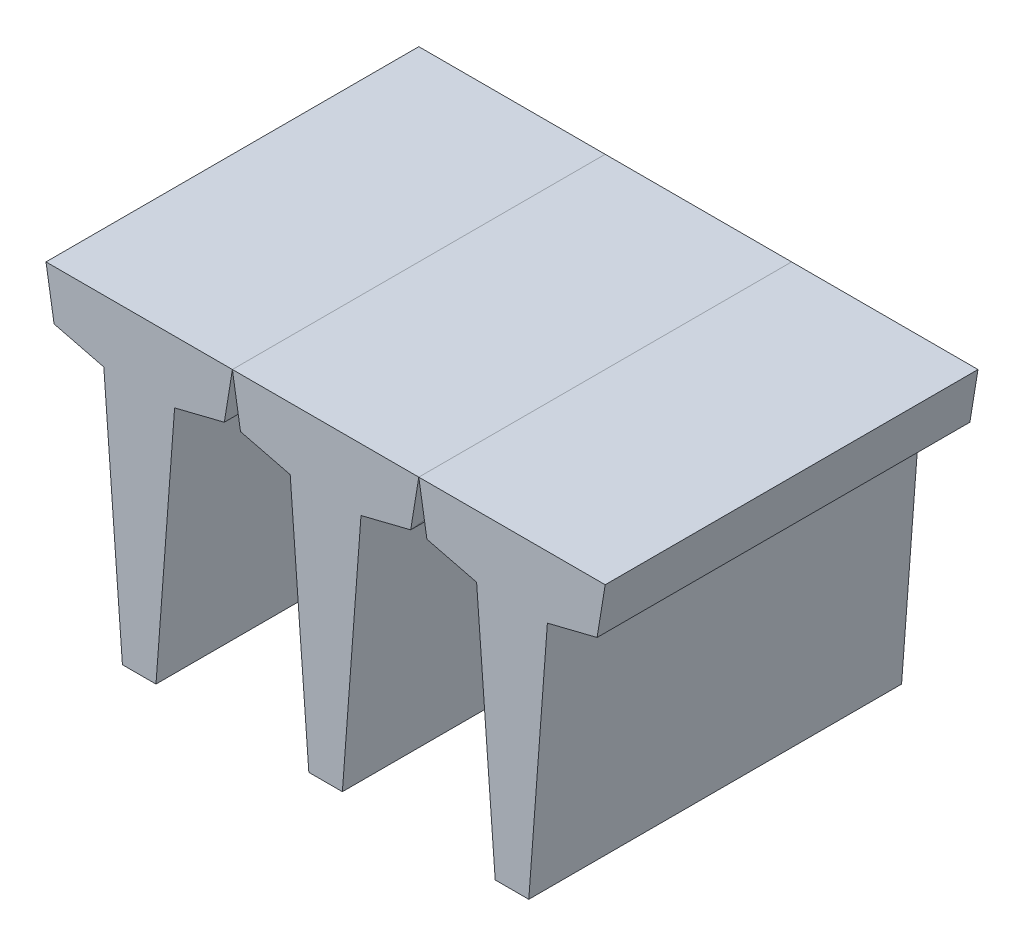
ISO-10303-21;
HEADER;
FILE_DESCRIPTION(('STEP AP214'),'2;1');
FILE_NAME('part.step','',(''),(''),'','','');
FILE_SCHEMA(('AUTOMOTIVE_DESIGN { 1 0 10303 214 1 1 1 1 }'));
ENDSEC;
DATA;
#1=APPLICATION_CONTEXT('core data for automotive mechanical design processes');
#2=APPLICATION_PROTOCOL_DEFINITION('international standard','automotive_design',2000,#1);
#3=PRODUCT_CONTEXT('',#1,'mechanical');
#4=PRODUCT('Part','Part','',(#3));
#5=PRODUCT_RELATED_PRODUCT_CATEGORY('part','',(#4));
#6=PRODUCT_DEFINITION_FORMATION('','',#4);
#7=PRODUCT_DEFINITION_CONTEXT('part definition',#1,'design');
#8=PRODUCT_DEFINITION('design','',#6,#7);
#9=PRODUCT_DEFINITION_SHAPE('','',#8);
#10=(LENGTH_UNIT() NAMED_UNIT(*) SI_UNIT(.MILLI.,.METRE.));
#11=(NAMED_UNIT(*) PLANE_ANGLE_UNIT() SI_UNIT($,.RADIAN.));
#12=(NAMED_UNIT(*) SI_UNIT($,.STERADIAN.) SOLID_ANGLE_UNIT());
#13=UNCERTAINTY_MEASURE_WITH_UNIT(LENGTH_MEASURE(1.E-05),#10,'distance_accuracy_value','');
#14=(GEOMETRIC_REPRESENTATION_CONTEXT(3) GLOBAL_UNCERTAINTY_ASSIGNED_CONTEXT((#13)) GLOBAL_UNIT_ASSIGNED_CONTEXT((#10,
#11,#12)) REPRESENTATION_CONTEXT('',''));
#15=CARTESIAN_POINT('',(0.,0.,0.));
#16=DIRECTION('',(0.,0.,1.));
#17=DIRECTION('',(1.,0.,0.));
#18=AXIS2_PLACEMENT_3D('',#15,#16,#17);
#19=CARTESIAN_POINT('',(-271.946864525165,-20.3667142399668,3000.));
#20=DIRECTION('',(-0.997207317311785,-0.0746831058528849,0.));
#21=DIRECTION('',(0.0746831058528849,-0.997207317311785,0.));
#22=AXIS2_PLACEMENT_3D('',#19,#20,#21);
#23=PLANE('',#22);
#24=DIRECTION('',(-0.0746831058528849,0.997207317311785,0.));
#25=VECTOR('',#24,1.);
#26=CARTESIAN_POINT('',(-271.946864525165,-20.3667142399668,0.));
#27=LINE('',#26,#25);
#28=CARTESIAN_POINT('',(-135.02426812289,-1848.6277845099,0.));
#29=VERTEX_POINT('',#28);
#30=CARTESIAN_POINT('',(-284.808780443179,151.372215490104,0.));
#31=VERTEX_POINT('',#30);
#32=EDGE_CURVE('E153',#29,#31,#27,.T.);
#33=ORIENTED_EDGE('',*,*,#32,.F.);
#34=DIRECTION('',(0.,0.,-1.));
#35=VECTOR('',#34,1.);
#36=CARTESIAN_POINT('',(-135.02426812289,-1848.6277845099,3000.));
#37=LINE('',#36,#35);
#38=CARTESIAN_POINT('',(-135.02426812289,-1848.6277845099,3000.));
#39=VERTEX_POINT('',#38);
#40=EDGE_CURVE('E12',#39,#29,#37,.T.);
#41=ORIENTED_EDGE('',*,*,#40,.F.);
#42=DIRECTION('',(-0.0746831058528849,0.997207317311785,0.));
#43=VECTOR('',#42,1.);
#44=CARTESIAN_POINT('',(-271.946864525165,-20.3667142399668,3000.));
#45=LINE('',#44,#43);
#46=CARTESIAN_POINT('',(-284.808780443179,151.372215490104,3000.));
#47=VERTEX_POINT('',#46);
#48=EDGE_CURVE('E177',#39,#47,#45,.T.);
#49=ORIENTED_EDGE('',*,*,#48,.T.);
#50=DIRECTION('',(0.,0.,-1.));
#51=VECTOR('',#50,1.);
#52=CARTESIAN_POINT('',(-284.808780443179,151.372215490104,3000.));
#53=LINE('',#52,#51);
#54=EDGE_CURVE('E71',#47,#31,#53,.T.);
#55=ORIENTED_EDGE('',*,*,#54,.T.);
#56=EDGE_LOOP('',(#33,#41,#49,#55));
#57=FACE_BOUND('',#56,.T.);
#58=ADVANCED_FACE('F54',(#57),#23,.T.);
#59=CARTESIAN_POINT('',(0.,-1848.6277845099,3000.));
#60=DIRECTION('',(0.,1.,0.));
#61=DIRECTION('',(0.,0.,1.));
#62=AXIS2_PLACEMENT_3D('',#59,#60,#61);
#63=PLANE('',#62);
#64=DIRECTION('',(1.,0.,0.));
#65=VECTOR('',#64,1.);
#66=CARTESIAN_POINT('',(0.,-1848.6277845099,0.));
#67=LINE('',#66,#65);
#68=CARTESIAN_POINT('',(135.02426812289,-1848.6277845099,0.));
#69=VERTEX_POINT('',#68);
#70=EDGE_CURVE('E156',#29,#69,#67,.T.);
#71=ORIENTED_EDGE('',*,*,#70,.T.);
#72=DIRECTION('',(0.,0.,-1.));
#73=VECTOR('',#72,1.);
#74=CARTESIAN_POINT('',(135.02426812289,-1848.6277845099,3000.));
#75=LINE('',#74,#73);
#76=CARTESIAN_POINT('',(135.02426812289,-1848.6277845099,3000.));
#77=VERTEX_POINT('',#76);
#78=EDGE_CURVE('E63',#77,#69,#75,.T.);
#79=ORIENTED_EDGE('',*,*,#78,.F.);
#80=DIRECTION('',(1.,0.,0.));
#81=VECTOR('',#80,1.);
#82=CARTESIAN_POINT('',(0.,-1848.6277845099,3000.));
#83=LINE('',#82,#81);
#84=EDGE_CURVE('E219',#39,#77,#83,.T.);
#85=ORIENTED_EDGE('',*,*,#84,.F.);
#86=ORIENTED_EDGE('',*,*,#40,.T.);
#87=EDGE_LOOP('',(#71,#79,#85,#86));
#88=FACE_BOUND('',#87,.T.);
#89=ADVANCED_FACE('F234',(#88),#63,.F.);
#90=CARTESIAN_POINT('',(271.946864525166,-20.3667142399668,3000.));
#91=DIRECTION('',(-0.997207317311785,0.0746831058528846,0.));
#92=DIRECTION('',(-0.0746831058528846,-0.997207317311785,0.));
#93=AXIS2_PLACEMENT_3D('',#90,#91,#92);
#94=PLANE('',#93);
#95=DIRECTION('',(0.0746831058528846,0.997207317311785,0.));
#96=VECTOR('',#95,1.);
#97=CARTESIAN_POINT('',(271.946864525166,-20.3667142399668,0.));
#98=LINE('',#97,#96);
#99=CARTESIAN_POINT('',(284.808780443179,151.372215490104,0.));
#100=VERTEX_POINT('',#99);
#101=EDGE_CURVE('E159',#69,#100,#98,.T.);
#102=ORIENTED_EDGE('',*,*,#101,.T.);
#103=DIRECTION('',(0.,0.,-1.));
#104=VECTOR('',#103,1.);
#105=CARTESIAN_POINT('',(284.808780443179,151.372215490104,3000.));
#106=LINE('',#105,#104);
#107=CARTESIAN_POINT('',(284.808780443179,151.372215490104,3000.));
#108=VERTEX_POINT('',#107);
#109=EDGE_CURVE('E188',#108,#100,#106,.T.);
#110=ORIENTED_EDGE('',*,*,#109,.F.);
#111=DIRECTION('',(0.0746831058528846,0.997207317311785,0.));
#112=VECTOR('',#111,1.);
#113=CARTESIAN_POINT('',(271.946864525166,-20.3667142399668,3000.));
#114=LINE('',#113,#112);
#115=EDGE_CURVE('E199',#77,#108,#114,.T.);
#116=ORIENTED_EDGE('',*,*,#115,.F.);
#117=ORIENTED_EDGE('',*,*,#78,.T.);
#118=EDGE_LOOP('',(#102,#110,#116,#117));
#119=FACE_BOUND('',#118,.T.);
#120=ADVANCED_FACE('F197',(#119),#94,.F.);
#121=CARTESIAN_POINT('',(-18.8635342068963,75.454136827585,3000.));
#122=DIRECTION('',(-0.242535625036333,0.970142500145332,0.));
#123=DIRECTION('',(-0.970142500145332,-0.242535625036333,0.));
#124=AXIS2_PLACEMENT_3D('',#121,#122,#123);
#125=PLANE('',#124);
#126=DIRECTION('',(0.970142500145332,0.242535625036333,0.));
#127=VECTOR('',#126,1.);
#128=CARTESIAN_POINT('',(-18.8635342068963,75.454136827585,0.));
#129=LINE('',#128,#127);
#130=CARTESIAN_POINT('',(684.808780443179,251.372215490104,0.));
#131=VERTEX_POINT('',#130);
#132=EDGE_CURVE('E162',#100,#131,#129,.T.);
#133=ORIENTED_EDGE('',*,*,#132,.T.);
#134=DIRECTION('',(0.,0.,-1.));
#135=VECTOR('',#134,1.);
#136=CARTESIAN_POINT('',(684.808780443179,251.372215490104,3000.));
#137=LINE('',#136,#135);
#138=CARTESIAN_POINT('',(684.808780443179,251.372215490104,3000.));
#139=VERTEX_POINT('',#138);
#140=EDGE_CURVE('E184',#139,#131,#137,.T.);
#141=ORIENTED_EDGE('',*,*,#140,.F.);
#142=DIRECTION('',(0.970142500145332,0.242535625036333,0.));
#143=VECTOR('',#142,1.);
#144=CARTESIAN_POINT('',(-18.8635342068963,75.454136827585,3000.));
#145=LINE('',#144,#143);
#146=EDGE_CURVE('E213',#108,#139,#145,.T.);
#147=ORIENTED_EDGE('',*,*,#146,.F.);
#148=ORIENTED_EDGE('',*,*,#109,.T.);
#149=EDGE_LOOP('',(#133,#141,#147,#148));
#150=FACE_BOUND('',#149,.T.);
#151=ADVANCED_FACE('F208',(#150),#125,.F.);
#152=CARTESIAN_POINT('',(627.181529019599,-102.216821900748,3000.));
#153=DIRECTION('',(-0.986977928746855,0.160855737126682,0.));
#154=DIRECTION('',(-0.160855737126682,-0.986977928746855,0.));
#155=AXIS2_PLACEMENT_3D('',#152,#153,#154);
#156=PLANE('',#155);
#157=DIRECTION('',(0.160855737126682,0.986977928746855,0.));
#158=VECTOR('',#157,1.);
#159=CARTESIAN_POINT('',(627.181529019599,-102.216821900748,0.));
#160=LINE('',#159,#158);
#161=CARTESIAN_POINT('',(750.,651.372215490104,0.));
#162=VERTEX_POINT('',#161);
#163=EDGE_CURVE('E165',#131,#162,#160,.T.);
#164=ORIENTED_EDGE('',*,*,#163,.T.);
#165=DIRECTION('',(0.,0.,-1.));
#166=VECTOR('',#165,1.);
#167=CARTESIAN_POINT('',(750.,651.372215490104,3000.));
#168=LINE('',#167,#166);
#169=CARTESIAN_POINT('',(750.,651.372215490104,3000.));
#170=VERTEX_POINT('',#169);
#171=EDGE_CURVE('E143',#170,#162,#168,.T.);
#172=ORIENTED_EDGE('',*,*,#171,.F.);
#173=DIRECTION('',(0.160855737126682,0.986977928746855,0.));
#174=VECTOR('',#173,1.);
#175=CARTESIAN_POINT('',(627.181529019599,-102.216821900748,3000.));
#176=LINE('',#175,#174);
#177=EDGE_CURVE('E129',#139,#170,#176,.T.);
#178=ORIENTED_EDGE('',*,*,#177,.F.);
#179=ORIENTED_EDGE('',*,*,#140,.T.);
#180=EDGE_LOOP('',(#164,#172,#178,#179));
#181=FACE_BOUND('',#180,.T.);
#182=ADVANCED_FACE('F211',(#181),#156,.F.);
#183=CARTESIAN_POINT('',(0.,651.372215490104,3000.));
#184=DIRECTION('',(0.,-1.,0.));
#185=DIRECTION('',(0.,0.,-1.));
#186=AXIS2_PLACEMENT_3D('',#183,#184,#185);
#187=PLANE('',#186);
#188=DIRECTION('',(-1.,0.,0.));
#189=VECTOR('',#188,1.);
#190=CARTESIAN_POINT('',(0.,651.372215490104,0.));
#191=LINE('',#190,#189);
#192=CARTESIAN_POINT('',(-750.,651.372215490104,0.));
#193=VERTEX_POINT('',#192);
#194=EDGE_CURVE('E139',#162,#193,#191,.T.);
#195=ORIENTED_EDGE('',*,*,#194,.T.);
#196=DIRECTION('',(0.,0.,-1.));
#197=VECTOR('',#196,1.);
#198=CARTESIAN_POINT('',(-750.,651.372215490104,3000.));
#199=LINE('',#198,#197);
#200=CARTESIAN_POINT('',(-750.,651.372215490104,3000.));
#201=VERTEX_POINT('',#200);
#202=EDGE_CURVE('E136',#201,#193,#199,.T.);
#203=ORIENTED_EDGE('',*,*,#202,.F.);
#204=DIRECTION('',(-1.,0.,0.));
#205=VECTOR('',#204,1.);
#206=CARTESIAN_POINT('',(0.,651.372215490104,3000.));
#207=LINE('',#206,#205);
#208=EDGE_CURVE('E121',#170,#201,#207,.T.);
#209=ORIENTED_EDGE('',*,*,#208,.F.);
#210=ORIENTED_EDGE('',*,*,#171,.T.);
#211=EDGE_LOOP('',(#195,#203,#209,#210));
#212=FACE_BOUND('',#211,.T.);
#213=ADVANCED_FACE('F137',(#212),#187,.F.);
#214=CARTESIAN_POINT('',(-627.181529019599,-102.216821900748,3000.));
#215=DIRECTION('',(-0.986977928746855,-0.160855737126681,0.));
#216=DIRECTION('',(0.160855737126681,-0.986977928746855,0.));
#217=AXIS2_PLACEMENT_3D('',#214,#215,#216);
#218=PLANE('',#217);
#219=DIRECTION('',(-0.160855737126682,0.986977928746855,0.));
#220=VECTOR('',#219,1.);
#221=CARTESIAN_POINT('',(-627.181529019599,-102.216821900748,0.));
#222=LINE('',#221,#220);
#223=CARTESIAN_POINT('',(-684.808780443179,251.372215490104,0.));
#224=VERTEX_POINT('',#223);
#225=EDGE_CURVE('E170',#224,#193,#222,.T.);
#226=ORIENTED_EDGE('',*,*,#225,.F.);
#227=DIRECTION('',(0.,0.,-1.));
#228=VECTOR('',#227,1.);
#229=CARTESIAN_POINT('',(-684.808780443179,251.372215490104,3000.));
#230=LINE('',#229,#228);
#231=CARTESIAN_POINT('',(-684.808780443179,251.372215490104,3000.));
#232=VERTEX_POINT('',#231);
#233=EDGE_CURVE('E96',#232,#224,#230,.T.);
#234=ORIENTED_EDGE('',*,*,#233,.F.);
#235=DIRECTION('',(-0.160855737126682,0.986977928746855,0.));
#236=VECTOR('',#235,1.);
#237=CARTESIAN_POINT('',(-627.181529019599,-102.216821900748,3000.));
#238=LINE('',#237,#236);
#239=EDGE_CURVE('E127',#232,#201,#238,.T.);
#240=ORIENTED_EDGE('',*,*,#239,.T.);
#241=ORIENTED_EDGE('',*,*,#202,.T.);
#242=EDGE_LOOP('',(#226,#234,#240,#241));
#243=FACE_BOUND('',#242,.T.);
#244=ADVANCED_FACE('F145',(#243),#218,.T.);
#245=CARTESIAN_POINT('',(18.8635342068963,75.4541368275851,3000.));
#246=DIRECTION('',(-0.242535625036333,-0.970142500145332,0.));
#247=DIRECTION('',(0.970142500145332,-0.242535625036333,0.));
#248=AXIS2_PLACEMENT_3D('',#245,#246,#247);
#249=PLANE('',#248);
#250=DIRECTION('',(-0.970142500145332,0.242535625036333,0.));
#251=VECTOR('',#250,1.);
#252=CARTESIAN_POINT('',(18.8635342068963,75.4541368275851,0.));
#253=LINE('',#252,#251);
#254=EDGE_CURVE('E173',#31,#224,#253,.T.);
#255=ORIENTED_EDGE('',*,*,#254,.F.);
#256=ORIENTED_EDGE('',*,*,#54,.F.);
#257=DIRECTION('',(-0.970142500145332,0.242535625036333,0.));
#258=VECTOR('',#257,1.);
#259=CARTESIAN_POINT('',(18.8635342068963,75.4541368275851,3000.));
#260=LINE('',#259,#258);
#261=EDGE_CURVE('E147',#47,#232,#260,.T.);
#262=ORIENTED_EDGE('',*,*,#261,.T.);
#263=ORIENTED_EDGE('',*,*,#233,.T.);
#264=EDGE_LOOP('',(#255,#256,#262,#263));
#265=FACE_BOUND('',#264,.T.);
#266=ADVANCED_FACE('F223',(#265),#249,.T.);
#267=CARTESIAN_POINT('',(0.,0.,3000.));
#268=DIRECTION('',(0.,0.,1.));
#269=DIRECTION('',(1.,0.,0.));
#270=AXIS2_PLACEMENT_3D('',#267,#268,#269);
#271=PLANE('',#270);
#272=ORIENTED_EDGE('',*,*,#48,.F.);
#273=ORIENTED_EDGE('',*,*,#84,.T.);
#274=ORIENTED_EDGE('',*,*,#115,.T.);
#275=ORIENTED_EDGE('',*,*,#146,.T.);
#276=ORIENTED_EDGE('',*,*,#177,.T.);
#277=ORIENTED_EDGE('',*,*,#208,.T.);
#278=ORIENTED_EDGE('',*,*,#239,.F.);
#279=ORIENTED_EDGE('',*,*,#261,.F.);
#280=EDGE_LOOP('',(#272,#273,#274,#275,#276,#277,#278,#279));
#281=FACE_BOUND('',#280,.T.);
#282=ADVANCED_FACE('F124',(#281),#271,.T.);
#283=CARTESIAN_POINT('',(0.,0.,0.));
#284=DIRECTION('',(0.,0.,1.));
#285=DIRECTION('',(1.,0.,0.));
#286=AXIS2_PLACEMENT_3D('',#283,#284,#285);
#287=PLANE('',#286);
#288=ORIENTED_EDGE('',*,*,#32,.T.);
#289=ORIENTED_EDGE('',*,*,#254,.T.);
#290=ORIENTED_EDGE('',*,*,#225,.T.);
#291=ORIENTED_EDGE('',*,*,#194,.F.);
#292=ORIENTED_EDGE('',*,*,#163,.F.);
#293=ORIENTED_EDGE('',*,*,#132,.F.);
#294=ORIENTED_EDGE('',*,*,#101,.F.);
#295=ORIENTED_EDGE('',*,*,#70,.F.);
#296=EDGE_LOOP('',(#288,#289,#290,#291,#292,#293,#294,#295));
#297=FACE_BOUND('',#296,.T.);
#298=ADVANCED_FACE('F204',(#297),#287,.F.);
#299=CLOSED_SHELL('',(#58,#89,#120,#151,#182,#213,#244,#266,#282,#298));
#300=MANIFOLD_SOLID_BREP('B2',#299);
#301=CARTESIAN_POINT('',(-1771.94686452517,-20.3667142399668,3000.));
#302=DIRECTION('',(-0.997207317311785,-0.0746831058528849,0.));
#303=DIRECTION('',(0.0746831058528849,-0.997207317311785,0.));
#304=AXIS2_PLACEMENT_3D('',#301,#302,#303);
#305=PLANE('',#304);
#306=DIRECTION('',(-0.0746831058528849,0.997207317311785,0.));
#307=VECTOR('',#306,1.);
#308=CARTESIAN_POINT('',(-1771.94686452517,-20.3667142399668,0.));
#309=LINE('',#308,#307);
#310=CARTESIAN_POINT('',(-1635.02426812289,-1848.6277845099,0.));
#311=VERTEX_POINT('',#310);
#312=CARTESIAN_POINT('',(-1784.80878044318,151.372215490104,0.));
#313=VERTEX_POINT('',#312);
#314=EDGE_CURVE('E416',#311,#313,#309,.T.);
#315=ORIENTED_EDGE('',*,*,#314,.F.);
#316=DIRECTION('',(0.,0.,-1.));
#317=VECTOR('',#316,1.);
#318=CARTESIAN_POINT('',(-1635.02426812289,-1848.6277845099,3000.));
#319=LINE('',#318,#317);
#320=CARTESIAN_POINT('',(-1635.02426812289,-1848.6277845099,3000.));
#321=VERTEX_POINT('',#320);
#322=EDGE_CURVE('E52',#321,#311,#319,.T.);
#323=ORIENTED_EDGE('',*,*,#322,.F.);
#324=DIRECTION('',(-0.0746831058528849,0.997207317311785,0.));
#325=VECTOR('',#324,1.);
#326=CARTESIAN_POINT('',(-1771.94686452517,-20.3667142399668,3000.));
#327=LINE('',#326,#325);
#328=CARTESIAN_POINT('',(-1784.80878044318,151.372215490104,3000.));
#329=VERTEX_POINT('',#328);
#330=EDGE_CURVE('E432',#321,#329,#327,.T.);
#331=ORIENTED_EDGE('',*,*,#330,.T.);
#332=DIRECTION('',(0.,0.,-1.));
#333=VECTOR('',#332,1.);
#334=CARTESIAN_POINT('',(-1784.80878044318,151.372215490104,3000.));
#335=LINE('',#334,#333);
#336=EDGE_CURVE('E338',#329,#313,#335,.T.);
#337=ORIENTED_EDGE('',*,*,#336,.T.);
#338=EDGE_LOOP('',(#315,#323,#331,#337));
#339=FACE_BOUND('',#338,.T.);
#340=ADVANCED_FACE('F322',(#339),#305,.T.);
#341=CARTESIAN_POINT('',(-1500.,-1848.6277845099,3000.));
#342=DIRECTION('',(0.,1.,0.));
#343=DIRECTION('',(0.,0.,1.));
#344=AXIS2_PLACEMENT_3D('',#341,#342,#343);
#345=PLANE('',#344);
#346=DIRECTION('',(1.,0.,0.));
#347=VECTOR('',#346,1.);
#348=CARTESIAN_POINT('',(-1500.,-1848.6277845099,0.));
#349=LINE('',#348,#347);
#350=CARTESIAN_POINT('',(-1364.97573187711,-1848.6277845099,0.));
#351=VERTEX_POINT('',#350);
#352=EDGE_CURVE('E418',#311,#351,#349,.T.);
#353=ORIENTED_EDGE('',*,*,#352,.T.);
#354=DIRECTION('',(0.,0.,-1.));
#355=VECTOR('',#354,1.);
#356=CARTESIAN_POINT('',(-1364.97573187711,-1848.6277845099,3000.));
#357=LINE('',#356,#355);
#358=CARTESIAN_POINT('',(-1364.97573187711,-1848.6277845099,3000.));
#359=VERTEX_POINT('',#358);
#360=EDGE_CURVE('E330',#359,#351,#357,.T.);
#361=ORIENTED_EDGE('',*,*,#360,.F.);
#362=DIRECTION('',(1.,0.,0.));
#363=VECTOR('',#362,1.);
#364=CARTESIAN_POINT('',(-1500.,-1848.6277845099,3000.));
#365=LINE('',#364,#363);
#366=EDGE_CURVE('E465',#321,#359,#365,.T.);
#367=ORIENTED_EDGE('',*,*,#366,.F.);
#368=ORIENTED_EDGE('',*,*,#322,.T.);
#369=EDGE_LOOP('',(#353,#361,#367,#368));
#370=FACE_BOUND('',#369,.T.);
#371=ADVANCED_FACE('F478',(#370),#345,.F.);
#372=CARTESIAN_POINT('',(-1228.05313547483,-20.3667142399668,3000.));
#373=DIRECTION('',(-0.997207317311785,0.0746831058528846,0.));
#374=DIRECTION('',(-0.0746831058528846,-0.997207317311785,0.));
#375=AXIS2_PLACEMENT_3D('',#372,#373,#374);
#376=PLANE('',#375);
#377=DIRECTION('',(0.0746831058528846,0.997207317311785,0.));
#378=VECTOR('',#377,1.);
#379=CARTESIAN_POINT('',(-1228.05313547483,-20.3667142399668,0.));
#380=LINE('',#379,#378);
#381=CARTESIAN_POINT('',(-1215.19121955682,151.372215490104,0.));
#382=VERTEX_POINT('',#381);
#383=EDGE_CURVE('E420',#351,#382,#380,.T.);
#384=ORIENTED_EDGE('',*,*,#383,.T.);
#385=DIRECTION('',(0.,0.,-1.));
#386=VECTOR('',#385,1.);
#387=CARTESIAN_POINT('',(-1215.19121955682,151.372215490104,3000.));
#388=LINE('',#387,#386);
#389=CARTESIAN_POINT('',(-1215.19121955682,151.372215490104,3000.));
#390=VERTEX_POINT('',#389);
#391=EDGE_CURVE('E439',#390,#382,#388,.T.);
#392=ORIENTED_EDGE('',*,*,#391,.F.);
#393=DIRECTION('',(0.0746831058528846,0.997207317311785,0.));
#394=VECTOR('',#393,1.);
#395=CARTESIAN_POINT('',(-1228.05313547483,-20.3667142399668,3000.));
#396=LINE('',#395,#394);
#397=EDGE_CURVE('E448',#359,#390,#396,.T.);
#398=ORIENTED_EDGE('',*,*,#397,.F.);
#399=ORIENTED_EDGE('',*,*,#360,.T.);
#400=EDGE_LOOP('',(#384,#392,#398,#399));
#401=FACE_BOUND('',#400,.T.);
#402=ADVANCED_FACE('F446',(#401),#376,.F.);
#403=CARTESIAN_POINT('',(-1518.8635342069,75.454136827585,3000.));
#404=DIRECTION('',(-0.242535625036333,0.970142500145332,0.));
#405=DIRECTION('',(-0.970142500145332,-0.242535625036333,0.));
#406=AXIS2_PLACEMENT_3D('',#403,#404,#405);
#407=PLANE('',#406);
#408=DIRECTION('',(0.970142500145332,0.242535625036333,0.));
#409=VECTOR('',#408,1.);
#410=CARTESIAN_POINT('',(-1518.8635342069,75.454136827585,0.));
#411=LINE('',#410,#409);
#412=CARTESIAN_POINT('',(-815.191219556821,251.372215490104,0.));
#413=VERTEX_POINT('',#412);
#414=EDGE_CURVE('E422',#382,#413,#411,.T.);
#415=ORIENTED_EDGE('',*,*,#414,.T.);
#416=DIRECTION('',(0.,0.,-1.));
#417=VECTOR('',#416,1.);
#418=CARTESIAN_POINT('',(-815.191219556821,251.372215490104,3000.));
#419=LINE('',#418,#417);
#420=CARTESIAN_POINT('',(-815.191219556821,251.372215490104,3000.));
#421=VERTEX_POINT('',#420);
#422=EDGE_CURVE('E436',#421,#413,#419,.T.);
#423=ORIENTED_EDGE('',*,*,#422,.F.);
#424=DIRECTION('',(0.970142500145332,0.242535625036333,0.));
#425=VECTOR('',#424,1.);
#426=CARTESIAN_POINT('',(-1518.8635342069,75.454136827585,3000.));
#427=LINE('',#426,#425);
#428=EDGE_CURVE('E461',#390,#421,#427,.T.);
#429=ORIENTED_EDGE('',*,*,#428,.F.);
#430=ORIENTED_EDGE('',*,*,#391,.T.);
#431=EDGE_LOOP('',(#415,#423,#429,#430));
#432=FACE_BOUND('',#431,.T.);
#433=ADVANCED_FACE('F457',(#432),#407,.F.);
#434=CARTESIAN_POINT('',(-872.818470980401,-102.216821900748,3000.));
#435=DIRECTION('',(-0.986977928746855,0.160855737126682,0.));
#436=DIRECTION('',(-0.160855737126682,-0.986977928746855,0.));
#437=AXIS2_PLACEMENT_3D('',#434,#435,#436);
#438=PLANE('',#437);
#439=DIRECTION('',(0.160855737126682,0.986977928746855,0.));
#440=VECTOR('',#439,1.);
#441=CARTESIAN_POINT('',(-872.818470980401,-102.216821900748,0.));
#442=LINE('',#441,#440);
#443=CARTESIAN_POINT('',(-750.,651.372215490104,0.));
#444=VERTEX_POINT('',#443);
#445=EDGE_CURVE('E424',#413,#444,#442,.T.);
#446=ORIENTED_EDGE('',*,*,#445,.T.);
#447=DIRECTION('',(0.,0.,-1.));
#448=VECTOR('',#447,1.);
#449=CARTESIAN_POINT('',(-750.,651.372215490104,3000.));
#450=LINE('',#449,#448);
#451=CARTESIAN_POINT('',(-750.,651.372215490104,3000.));
#452=VERTEX_POINT('',#451);
#453=EDGE_CURVE('E408',#452,#444,#450,.T.);
#454=ORIENTED_EDGE('',*,*,#453,.F.);
#455=DIRECTION('',(0.160855737126682,0.986977928746855,0.));
#456=VECTOR('',#455,1.);
#457=CARTESIAN_POINT('',(-872.818470980401,-102.216821900748,3000.));
#458=LINE('',#457,#456);
#459=EDGE_CURVE('E396',#421,#452,#458,.T.);
#460=ORIENTED_EDGE('',*,*,#459,.F.);
#461=ORIENTED_EDGE('',*,*,#422,.T.);
#462=EDGE_LOOP('',(#446,#454,#460,#461));
#463=FACE_BOUND('',#462,.T.);
#464=ADVANCED_FACE('F460',(#463),#438,.F.);
#465=CARTESIAN_POINT('',(-1500.,651.372215490104,3000.));
#466=DIRECTION('',(0.,-1.,0.));
#467=DIRECTION('',(0.,0.,-1.));
#468=AXIS2_PLACEMENT_3D('',#465,#466,#467);
#469=PLANE('',#468);
#470=DIRECTION('',(-1.,0.,0.));
#471=VECTOR('',#470,1.);
#472=CARTESIAN_POINT('',(-1500.,651.372215490104,0.));
#473=LINE('',#472,#471);
#474=CARTESIAN_POINT('',(-2250.,651.372215490104,0.));
#475=VERTEX_POINT('',#474);
#476=EDGE_CURVE('E405',#444,#475,#473,.T.);
#477=ORIENTED_EDGE('',*,*,#476,.T.);
#478=DIRECTION('',(0.,0.,-1.));
#479=VECTOR('',#478,1.);
#480=CARTESIAN_POINT('',(-2250.,651.372215490104,3000.));
#481=LINE('',#480,#479);
#482=CARTESIAN_POINT('',(-2250.,651.372215490104,3000.));
#483=VERTEX_POINT('',#482);
#484=EDGE_CURVE('E402',#483,#475,#481,.T.);
#485=ORIENTED_EDGE('',*,*,#484,.F.);
#486=DIRECTION('',(-1.,0.,0.));
#487=VECTOR('',#486,1.);
#488=CARTESIAN_POINT('',(-1500.,651.372215490104,3000.));
#489=LINE('',#488,#487);
#490=EDGE_CURVE('E388',#452,#483,#489,.T.);
#491=ORIENTED_EDGE('',*,*,#490,.F.);
#492=ORIENTED_EDGE('',*,*,#453,.T.);
#493=EDGE_LOOP('',(#477,#485,#491,#492));
#494=FACE_BOUND('',#493,.T.);
#495=ADVANCED_FACE('F403',(#494),#469,.F.);
#496=CARTESIAN_POINT('',(-2127.1815290196,-102.216821900748,3000.));
#497=DIRECTION('',(-0.986977928746855,-0.160855737126681,0.));
#498=DIRECTION('',(0.160855737126681,-0.986977928746855,0.));
#499=AXIS2_PLACEMENT_3D('',#496,#497,#498);
#500=PLANE('',#499);
#501=DIRECTION('',(-0.160855737126682,0.986977928746855,0.));
#502=VECTOR('',#501,1.);
#503=CARTESIAN_POINT('',(-2127.1815290196,-102.216821900748,0.));
#504=LINE('',#503,#502);
#505=CARTESIAN_POINT('',(-2184.80878044318,251.372215490104,0.));
#506=VERTEX_POINT('',#505);
#507=EDGE_CURVE('E427',#506,#475,#504,.T.);
#508=ORIENTED_EDGE('',*,*,#507,.F.);
#509=DIRECTION('',(0.,0.,-1.));
#510=VECTOR('',#509,1.);
#511=CARTESIAN_POINT('',(-2184.80878044318,251.372215490104,3000.));
#512=LINE('',#511,#510);
#513=CARTESIAN_POINT('',(-2184.80878044318,251.372215490104,3000.));
#514=VERTEX_POINT('',#513);
#515=EDGE_CURVE('E363',#514,#506,#512,.T.);
#516=ORIENTED_EDGE('',*,*,#515,.F.);
#517=DIRECTION('',(-0.160855737126682,0.986977928746855,0.));
#518=VECTOR('',#517,1.);
#519=CARTESIAN_POINT('',(-2127.1815290196,-102.216821900748,3000.));
#520=LINE('',#519,#518);
#521=EDGE_CURVE('E394',#514,#483,#520,.T.);
#522=ORIENTED_EDGE('',*,*,#521,.T.);
#523=ORIENTED_EDGE('',*,*,#484,.T.);
#524=EDGE_LOOP('',(#508,#516,#522,#523));
#525=FACE_BOUND('',#524,.T.);
#526=ADVANCED_FACE('F410',(#525),#500,.T.);
#527=CARTESIAN_POINT('',(-1481.1364657931,75.4541368275851,3000.));
#528=DIRECTION('',(-0.242535625036333,-0.970142500145332,0.));
#529=DIRECTION('',(0.970142500145332,-0.242535625036333,0.));
#530=AXIS2_PLACEMENT_3D('',#527,#528,#529);
#531=PLANE('',#530);
#532=DIRECTION('',(-0.970142500145332,0.242535625036333,0.));
#533=VECTOR('',#532,1.);
#534=CARTESIAN_POINT('',(-1481.1364657931,75.4541368275851,0.));
#535=LINE('',#534,#533);
#536=EDGE_CURVE('E429',#313,#506,#535,.T.);
#537=ORIENTED_EDGE('',*,*,#536,.F.);
#538=ORIENTED_EDGE('',*,*,#336,.F.);
#539=DIRECTION('',(-0.970142500145332,0.242535625036333,0.));
#540=VECTOR('',#539,1.);
#541=CARTESIAN_POINT('',(-1481.1364657931,75.4541368275851,3000.));
#542=LINE('',#541,#540);
#543=EDGE_CURVE('E411',#329,#514,#542,.T.);
#544=ORIENTED_EDGE('',*,*,#543,.T.);
#545=ORIENTED_EDGE('',*,*,#515,.T.);
#546=EDGE_LOOP('',(#537,#538,#544,#545));
#547=FACE_BOUND('',#546,.T.);
#548=ADVANCED_FACE('F467',(#547),#531,.T.);
#549=CARTESIAN_POINT('',(-1500.,0.,3000.));
#550=DIRECTION('',(0.,0.,1.));
#551=DIRECTION('',(1.,0.,0.));
#552=AXIS2_PLACEMENT_3D('',#549,#550,#551);
#553=PLANE('',#552);
#554=ORIENTED_EDGE('',*,*,#330,.F.);
#555=ORIENTED_EDGE('',*,*,#366,.T.);
#556=ORIENTED_EDGE('',*,*,#397,.T.);
#557=ORIENTED_EDGE('',*,*,#428,.T.);
#558=ORIENTED_EDGE('',*,*,#459,.T.);
#559=ORIENTED_EDGE('',*,*,#490,.T.);
#560=ORIENTED_EDGE('',*,*,#521,.F.);
#561=ORIENTED_EDGE('',*,*,#543,.F.);
#562=EDGE_LOOP('',(#554,#555,#556,#557,#558,#559,#560,#561));
#563=FACE_BOUND('',#562,.T.);
#564=ADVANCED_FACE('F391',(#563),#553,.T.);
#565=CARTESIAN_POINT('',(-1500.,0.,0.));
#566=DIRECTION('',(0.,0.,1.));
#567=DIRECTION('',(1.,0.,0.));
#568=AXIS2_PLACEMENT_3D('',#565,#566,#567);
#569=PLANE('',#568);
#570=ORIENTED_EDGE('',*,*,#314,.T.);
#571=ORIENTED_EDGE('',*,*,#536,.T.);
#572=ORIENTED_EDGE('',*,*,#507,.T.);
#573=ORIENTED_EDGE('',*,*,#476,.F.);
#574=ORIENTED_EDGE('',*,*,#445,.F.);
#575=ORIENTED_EDGE('',*,*,#414,.F.);
#576=ORIENTED_EDGE('',*,*,#383,.F.);
#577=ORIENTED_EDGE('',*,*,#352,.F.);
#578=EDGE_LOOP('',(#570,#571,#572,#573,#574,#575,#576,#577));
#579=FACE_BOUND('',#578,.T.);
#580=ADVANCED_FACE('F453',(#579),#569,.F.);
#581=CLOSED_SHELL('',(#340,#371,#402,#433,#464,#495,#526,#548,#564,#580));
#582=MANIFOLD_SOLID_BREP('B6',#581);
#583=CARTESIAN_POINT('',(1228.05313547483,-20.3667142399668,3000.));
#584=DIRECTION('',(-0.997207317311785,-0.0746831058528849,0.));
#585=DIRECTION('',(0.0746831058528849,-0.997207317311785,0.));
#586=AXIS2_PLACEMENT_3D('',#583,#584,#585);
#587=PLANE('',#586);
#588=DIRECTION('',(-0.0746831058528849,0.997207317311785,0.));
#589=VECTOR('',#588,1.);
#590=CARTESIAN_POINT('',(1228.05313547483,-20.3667142399668,0.));
#591=LINE('',#590,#589);
#592=CARTESIAN_POINT('',(1364.97573187711,-1848.6277845099,0.));
#593=VERTEX_POINT('',#592);
#594=CARTESIAN_POINT('',(1215.19121955682,151.372215490104,0.));
#595=VERTEX_POINT('',#594);
#596=EDGE_CURVE('E659',#593,#595,#591,.T.);
#597=ORIENTED_EDGE('',*,*,#596,.F.);
#598=DIRECTION('',(0.,0.,-1.));
#599=VECTOR('',#598,1.);
#600=CARTESIAN_POINT('',(1364.97573187711,-1848.6277845099,3000.));
#601=LINE('',#600,#599);
#602=CARTESIAN_POINT('',(1364.97573187711,-1848.6277845099,3000.));
#603=VERTEX_POINT('',#602);
#604=EDGE_CURVE('E320',#603,#593,#601,.T.);
#605=ORIENTED_EDGE('',*,*,#604,.F.);
#606=DIRECTION('',(-0.0746831058528849,0.997207317311785,0.));
#607=VECTOR('',#606,1.);
#608=CARTESIAN_POINT('',(1228.05313547483,-20.3667142399668,3000.));
#609=LINE('',#608,#607);
#610=CARTESIAN_POINT('',(1215.19121955682,151.372215490104,3000.));
#611=VERTEX_POINT('',#610);
#612=EDGE_CURVE('E675',#603,#611,#609,.T.);
#613=ORIENTED_EDGE('',*,*,#612,.T.);
#614=DIRECTION('',(0.,0.,-1.));
#615=VECTOR('',#614,1.);
#616=CARTESIAN_POINT('',(1215.19121955682,151.372215490104,3000.));
#617=LINE('',#616,#615);
#618=EDGE_CURVE('E581',#611,#595,#617,.T.);
#619=ORIENTED_EDGE('',*,*,#618,.T.);
#620=EDGE_LOOP('',(#597,#605,#613,#619));
#621=FACE_BOUND('',#620,.T.);
#622=ADVANCED_FACE('F565',(#621),#587,.T.);
#623=CARTESIAN_POINT('',(1500.,-1848.6277845099,3000.));
#624=DIRECTION('',(0.,1.,0.));
#625=DIRECTION('',(0.,0.,1.));
#626=AXIS2_PLACEMENT_3D('',#623,#624,#625);
#627=PLANE('',#626);
#628=DIRECTION('',(1.,0.,0.));
#629=VECTOR('',#628,1.);
#630=CARTESIAN_POINT('',(1500.,-1848.6277845099,0.));
#631=LINE('',#630,#629);
#632=CARTESIAN_POINT('',(1635.02426812289,-1848.6277845099,0.));
#633=VERTEX_POINT('',#632);
#634=EDGE_CURVE('E661',#593,#633,#631,.T.);
#635=ORIENTED_EDGE('',*,*,#634,.T.);
#636=DIRECTION('',(0.,0.,-1.));
#637=VECTOR('',#636,1.);
#638=CARTESIAN_POINT('',(1635.02426812289,-1848.6277845099,3000.));
#639=LINE('',#638,#637);
#640=CARTESIAN_POINT('',(1635.02426812289,-1848.6277845099,3000.));
#641=VERTEX_POINT('',#640);
#642=EDGE_CURVE('E573',#641,#633,#639,.T.);
#643=ORIENTED_EDGE('',*,*,#642,.F.);
#644=DIRECTION('',(1.,0.,0.));
#645=VECTOR('',#644,1.);
#646=CARTESIAN_POINT('',(1500.,-1848.6277845099,3000.));
#647=LINE('',#646,#645);
#648=EDGE_CURVE('E708',#603,#641,#647,.T.);
#649=ORIENTED_EDGE('',*,*,#648,.F.);
#650=ORIENTED_EDGE('',*,*,#604,.T.);
#651=EDGE_LOOP('',(#635,#643,#649,#650));
#652=FACE_BOUND('',#651,.T.);
#653=ADVANCED_FACE('F721',(#652),#627,.F.);
#654=CARTESIAN_POINT('',(1771.94686452517,-20.3667142399668,3000.));
#655=DIRECTION('',(-0.997207317311785,0.0746831058528846,0.));
#656=DIRECTION('',(-0.0746831058528846,-0.997207317311785,0.));
#657=AXIS2_PLACEMENT_3D('',#654,#655,#656);
#658=PLANE('',#657);
#659=DIRECTION('',(0.0746831058528846,0.997207317311785,0.));
#660=VECTOR('',#659,1.);
#661=CARTESIAN_POINT('',(1771.94686452517,-20.3667142399668,0.));
#662=LINE('',#661,#660);
#663=CARTESIAN_POINT('',(1784.80878044318,151.372215490104,0.));
#664=VERTEX_POINT('',#663);
#665=EDGE_CURVE('E663',#633,#664,#662,.T.);
#666=ORIENTED_EDGE('',*,*,#665,.T.);
#667=DIRECTION('',(0.,0.,-1.));
#668=VECTOR('',#667,1.);
#669=CARTESIAN_POINT('',(1784.80878044318,151.372215490104,3000.));
#670=LINE('',#669,#668);
#671=CARTESIAN_POINT('',(1784.80878044318,151.372215490104,3000.));
#672=VERTEX_POINT('',#671);
#673=EDGE_CURVE('E682',#672,#664,#670,.T.);
#674=ORIENTED_EDGE('',*,*,#673,.F.);
#675=DIRECTION('',(0.0746831058528846,0.997207317311785,0.));
#676=VECTOR('',#675,1.);
#677=CARTESIAN_POINT('',(1771.94686452517,-20.3667142399668,3000.));
#678=LINE('',#677,#676);
#679=EDGE_CURVE('E691',#641,#672,#678,.T.);
#680=ORIENTED_EDGE('',*,*,#679,.F.);
#681=ORIENTED_EDGE('',*,*,#642,.T.);
#682=EDGE_LOOP('',(#666,#674,#680,#681));
#683=FACE_BOUND('',#682,.T.);
#684=ADVANCED_FACE('F689',(#683),#658,.F.);
#685=CARTESIAN_POINT('',(1481.1364657931,75.454136827585,3000.));
#686=DIRECTION('',(-0.242535625036333,0.970142500145332,0.));
#687=DIRECTION('',(-0.970142500145332,-0.242535625036333,0.));
#688=AXIS2_PLACEMENT_3D('',#685,#686,#687);
#689=PLANE('',#688);
#690=DIRECTION('',(0.970142500145332,0.242535625036333,0.));
#691=VECTOR('',#690,1.);
#692=CARTESIAN_POINT('',(1481.1364657931,75.454136827585,0.));
#693=LINE('',#692,#691);
#694=CARTESIAN_POINT('',(2184.80878044318,251.372215490104,0.));
#695=VERTEX_POINT('',#694);
#696=EDGE_CURVE('E665',#664,#695,#693,.T.);
#697=ORIENTED_EDGE('',*,*,#696,.T.);
#698=DIRECTION('',(0.,0.,-1.));
#699=VECTOR('',#698,1.);
#700=CARTESIAN_POINT('',(2184.80878044318,251.372215490104,3000.));
#701=LINE('',#700,#699);
#702=CARTESIAN_POINT('',(2184.80878044318,251.372215490104,3000.));
#703=VERTEX_POINT('',#702);
#704=EDGE_CURVE('E679',#703,#695,#701,.T.);
#705=ORIENTED_EDGE('',*,*,#704,.F.);
#706=DIRECTION('',(0.970142500145332,0.242535625036333,0.));
#707=VECTOR('',#706,1.);
#708=CARTESIAN_POINT('',(1481.1364657931,75.454136827585,3000.));
#709=LINE('',#708,#707);
#710=EDGE_CURVE('E704',#672,#703,#709,.T.);
#711=ORIENTED_EDGE('',*,*,#710,.F.);
#712=ORIENTED_EDGE('',*,*,#673,.T.);
#713=EDGE_LOOP('',(#697,#705,#711,#712));
#714=FACE_BOUND('',#713,.T.);
#715=ADVANCED_FACE('F700',(#714),#689,.F.);
#716=CARTESIAN_POINT('',(2127.1815290196,-102.216821900748,3000.));
#717=DIRECTION('',(-0.986977928746855,0.160855737126682,0.));
#718=DIRECTION('',(-0.160855737126682,-0.986977928746855,0.));
#719=AXIS2_PLACEMENT_3D('',#716,#717,#718);
#720=PLANE('',#719);
#721=DIRECTION('',(0.160855737126682,0.986977928746855,0.));
#722=VECTOR('',#721,1.);
#723=CARTESIAN_POINT('',(2127.1815290196,-102.216821900748,0.));
#724=LINE('',#723,#722);
#725=CARTESIAN_POINT('',(2250.,651.372215490104,0.));
#726=VERTEX_POINT('',#725);
#727=EDGE_CURVE('E667',#695,#726,#724,.T.);
#728=ORIENTED_EDGE('',*,*,#727,.T.);
#729=DIRECTION('',(0.,0.,-1.));
#730=VECTOR('',#729,1.);
#731=CARTESIAN_POINT('',(2250.,651.372215490104,3000.));
#732=LINE('',#731,#730);
#733=CARTESIAN_POINT('',(2250.,651.372215490104,3000.));
#734=VERTEX_POINT('',#733);
#735=EDGE_CURVE('E651',#734,#726,#732,.T.);
#736=ORIENTED_EDGE('',*,*,#735,.F.);
#737=DIRECTION('',(0.160855737126682,0.986977928746855,0.));
#738=VECTOR('',#737,1.);
#739=CARTESIAN_POINT('',(2127.1815290196,-102.216821900748,3000.));
#740=LINE('',#739,#738);
#741=EDGE_CURVE('E639',#703,#734,#740,.T.);
#742=ORIENTED_EDGE('',*,*,#741,.F.);
#743=ORIENTED_EDGE('',*,*,#704,.T.);
#744=EDGE_LOOP('',(#728,#736,#742,#743));
#745=FACE_BOUND('',#744,.T.);
#746=ADVANCED_FACE('F703',(#745),#720,.F.);
#747=CARTESIAN_POINT('',(1500.,651.372215490104,3000.));
#748=DIRECTION('',(0.,-1.,0.));
#749=DIRECTION('',(0.,0.,-1.));
#750=AXIS2_PLACEMENT_3D('',#747,#748,#749);
#751=PLANE('',#750);
#752=DIRECTION('',(-1.,0.,0.));
#753=VECTOR('',#752,1.);
#754=CARTESIAN_POINT('',(1500.,651.372215490104,0.));
#755=LINE('',#754,#753);
#756=CARTESIAN_POINT('',(750.,651.372215490104,0.));
#757=VERTEX_POINT('',#756);
#758=EDGE_CURVE('E648',#726,#757,#755,.T.);
#759=ORIENTED_EDGE('',*,*,#758,.T.);
#760=DIRECTION('',(0.,0.,-1.));
#761=VECTOR('',#760,1.);
#762=CARTESIAN_POINT('',(750.,651.372215490104,3000.));
#763=LINE('',#762,#761);
#764=CARTESIAN_POINT('',(750.,651.372215490104,3000.));
#765=VERTEX_POINT('',#764);
#766=EDGE_CURVE('E645',#765,#757,#763,.T.);
#767=ORIENTED_EDGE('',*,*,#766,.F.);
#768=DIRECTION('',(-1.,0.,0.));
#769=VECTOR('',#768,1.);
#770=CARTESIAN_POINT('',(1500.,651.372215490104,3000.));
#771=LINE('',#770,#769);
#772=EDGE_CURVE('E631',#734,#765,#771,.T.);
#773=ORIENTED_EDGE('',*,*,#772,.F.);
#774=ORIENTED_EDGE('',*,*,#735,.T.);
#775=EDGE_LOOP('',(#759,#767,#773,#774));
#776=FACE_BOUND('',#775,.T.);
#777=ADVANCED_FACE('F646',(#776),#751,.F.);
#778=CARTESIAN_POINT('',(872.818470980401,-102.216821900748,3000.));
#779=DIRECTION('',(-0.986977928746855,-0.160855737126681,0.));
#780=DIRECTION('',(0.160855737126681,-0.986977928746855,0.));
#781=AXIS2_PLACEMENT_3D('',#778,#779,#780);
#782=PLANE('',#781);
#783=DIRECTION('',(-0.160855737126682,0.986977928746855,0.));
#784=VECTOR('',#783,1.);
#785=CARTESIAN_POINT('',(872.818470980401,-102.216821900748,0.));
#786=LINE('',#785,#784);
#787=CARTESIAN_POINT('',(815.191219556821,251.372215490104,0.));
#788=VERTEX_POINT('',#787);
#789=EDGE_CURVE('E670',#788,#757,#786,.T.);
#790=ORIENTED_EDGE('',*,*,#789,.F.);
#791=DIRECTION('',(0.,0.,-1.));
#792=VECTOR('',#791,1.);
#793=CARTESIAN_POINT('',(815.191219556821,251.372215490104,3000.));
#794=LINE('',#793,#792);
#795=CARTESIAN_POINT('',(815.191219556821,251.372215490104,3000.));
#796=VERTEX_POINT('',#795);
#797=EDGE_CURVE('E606',#796,#788,#794,.T.);
#798=ORIENTED_EDGE('',*,*,#797,.F.);
#799=DIRECTION('',(-0.160855737126682,0.986977928746855,0.));
#800=VECTOR('',#799,1.);
#801=CARTESIAN_POINT('',(872.818470980401,-102.216821900748,3000.));
#802=LINE('',#801,#800);
#803=EDGE_CURVE('E637',#796,#765,#802,.T.);
#804=ORIENTED_EDGE('',*,*,#803,.T.);
#805=ORIENTED_EDGE('',*,*,#766,.T.);
#806=EDGE_LOOP('',(#790,#798,#804,#805));
#807=FACE_BOUND('',#806,.T.);
#808=ADVANCED_FACE('F653',(#807),#782,.T.);
#809=CARTESIAN_POINT('',(1518.8635342069,75.4541368275851,3000.));
#810=DIRECTION('',(-0.242535625036333,-0.970142500145332,0.));
#811=DIRECTION('',(0.970142500145332,-0.242535625036333,0.));
#812=AXIS2_PLACEMENT_3D('',#809,#810,#811);
#813=PLANE('',#812);
#814=DIRECTION('',(-0.970142500145332,0.242535625036333,0.));
#815=VECTOR('',#814,1.);
#816=CARTESIAN_POINT('',(1518.8635342069,75.4541368275851,0.));
#817=LINE('',#816,#815);
#818=EDGE_CURVE('E672',#595,#788,#817,.T.);
#819=ORIENTED_EDGE('',*,*,#818,.F.);
#820=ORIENTED_EDGE('',*,*,#618,.F.);
#821=DIRECTION('',(-0.970142500145332,0.242535625036333,0.));
#822=VECTOR('',#821,1.);
#823=CARTESIAN_POINT('',(1518.8635342069,75.4541368275851,3000.));
#824=LINE('',#823,#822);
#825=EDGE_CURVE('E654',#611,#796,#824,.T.);
#826=ORIENTED_EDGE('',*,*,#825,.T.);
#827=ORIENTED_EDGE('',*,*,#797,.T.);
#828=EDGE_LOOP('',(#819,#820,#826,#827));
#829=FACE_BOUND('',#828,.T.);
#830=ADVANCED_FACE('F710',(#829),#813,.T.);
#831=CARTESIAN_POINT('',(1500.,0.,3000.));
#832=DIRECTION('',(0.,0.,1.));
#833=DIRECTION('',(1.,0.,0.));
#834=AXIS2_PLACEMENT_3D('',#831,#832,#833);
#835=PLANE('',#834);
#836=ORIENTED_EDGE('',*,*,#612,.F.);
#837=ORIENTED_EDGE('',*,*,#648,.T.);
#838=ORIENTED_EDGE('',*,*,#679,.T.);
#839=ORIENTED_EDGE('',*,*,#710,.T.);
#840=ORIENTED_EDGE('',*,*,#741,.T.);
#841=ORIENTED_EDGE('',*,*,#772,.T.);
#842=ORIENTED_EDGE('',*,*,#803,.F.);
#843=ORIENTED_EDGE('',*,*,#825,.F.);
#844=EDGE_LOOP('',(#836,#837,#838,#839,#840,#841,#842,#843));
#845=FACE_BOUND('',#844,.T.);
#846=ADVANCED_FACE('F634',(#845),#835,.T.);
#847=CARTESIAN_POINT('',(1500.,0.,0.));
#848=DIRECTION('',(0.,0.,1.));
#849=DIRECTION('',(1.,0.,0.));
#850=AXIS2_PLACEMENT_3D('',#847,#848,#849);
#851=PLANE('',#850);
#852=ORIENTED_EDGE('',*,*,#596,.T.);
#853=ORIENTED_EDGE('',*,*,#818,.T.);
#854=ORIENTED_EDGE('',*,*,#789,.T.);
#855=ORIENTED_EDGE('',*,*,#758,.F.);
#856=ORIENTED_EDGE('',*,*,#727,.F.);
#857=ORIENTED_EDGE('',*,*,#696,.F.);
#858=ORIENTED_EDGE('',*,*,#665,.F.);
#859=ORIENTED_EDGE('',*,*,#634,.F.);
#860=EDGE_LOOP('',(#852,#853,#854,#855,#856,#857,#858,#859));
#861=FACE_BOUND('',#860,.T.);
#862=ADVANCED_FACE('F696',(#861),#851,.F.);
#863=CLOSED_SHELL('',(#622,#653,#684,#715,#746,#777,#808,#830,#846,#862));
#864=MANIFOLD_SOLID_BREP('B46',#863);
#865=CARTESIAN_POINT('',(-271.946864525165,-20.3667142399668,3000.));
#866=DIRECTION('',(-0.997207317311785,-0.0746831058528849,0.));
#867=DIRECTION('',(0.0746831058528849,-0.997207317311785,0.));
#868=AXIS2_PLACEMENT_3D('',#865,#866,#867);
#869=PLANE('',#868);
#870=DIRECTION('',(-0.0746831058528849,0.997207317311785,0.));
#871=VECTOR('',#870,1.);
#872=CARTESIAN_POINT('',(-271.946864525165,-20.3667142399668,0.));
#873=LINE('',#872,#871);
#874=CARTESIAN_POINT('',(-135.02426812289,-1848.6277845099,0.));
#875=VERTEX_POINT('',#874);
#876=CARTESIAN_POINT('',(-284.808780443179,151.372215490104,0.));
#877=VERTEX_POINT('',#876);
#878=EDGE_CURVE('E893',#875,#877,#873,.T.);
#879=ORIENTED_EDGE('',*,*,#878,.F.);
#880=DIRECTION('',(0.,0.,-1.));
#881=VECTOR('',#880,1.);
#882=CARTESIAN_POINT('',(-135.02426812289,-1848.6277845099,3000.));
#883=LINE('',#882,#881);
#884=CARTESIAN_POINT('',(-135.02426812289,-1848.6277845099,3000.));
#885=VERTEX_POINT('',#884);
#886=EDGE_CURVE('E563',#885,#875,#883,.T.);
#887=ORIENTED_EDGE('',*,*,#886,.F.);
#888=DIRECTION('',(-0.0746831058528849,0.997207317311785,0.));
#889=VECTOR('',#888,1.);
#890=CARTESIAN_POINT('',(-271.946864525165,-20.3667142399668,3000.));
#891=LINE('',#890,#889);
#892=CARTESIAN_POINT('',(-284.808780443179,151.372215490104,3000.));
#893=VERTEX_POINT('',#892);
#894=EDGE_CURVE('E909',#885,#893,#891,.T.);
#895=ORIENTED_EDGE('',*,*,#894,.T.);
#896=DIRECTION('',(0.,0.,-1.));
#897=VECTOR('',#896,1.);
#898=CARTESIAN_POINT('',(-284.808780443179,151.372215490104,3000.));
#899=LINE('',#898,#897);
#900=EDGE_CURVE('E815',#893,#877,#899,.T.);
#901=ORIENTED_EDGE('',*,*,#900,.T.);
#902=EDGE_LOOP('',(#879,#887,#895,#901));
#903=FACE_BOUND('',#902,.T.);
#904=ADVANCED_FACE('F799',(#903),#869,.T.);
#905=CARTESIAN_POINT('',(0.,-1848.6277845099,3000.));
#906=DIRECTION('',(0.,1.,0.));
#907=DIRECTION('',(0.,0.,1.));
#908=AXIS2_PLACEMENT_3D('',#905,#906,#907);
#909=PLANE('',#908);
#910=DIRECTION('',(1.,0.,0.));
#911=VECTOR('',#910,1.);
#912=CARTESIAN_POINT('',(0.,-1848.6277845099,0.));
#913=LINE('',#912,#911);
#914=CARTESIAN_POINT('',(135.02426812289,-1848.6277845099,0.));
#915=VERTEX_POINT('',#914);
#916=EDGE_CURVE('E895',#875,#915,#913,.T.);
#917=ORIENTED_EDGE('',*,*,#916,.T.);
#918=DIRECTION('',(0.,0.,-1.));
#919=VECTOR('',#918,1.);
#920=CARTESIAN_POINT('',(135.02426812289,-1848.6277845099,3000.));
#921=LINE('',#920,#919);
#922=CARTESIAN_POINT('',(135.02426812289,-1848.6277845099,3000.));
#923=VERTEX_POINT('',#922);
#924=EDGE_CURVE('E807',#923,#915,#921,.T.);
#925=ORIENTED_EDGE('',*,*,#924,.F.);
#926=DIRECTION('',(1.,0.,0.));
#927=VECTOR('',#926,1.);
#928=CARTESIAN_POINT('',(0.,-1848.6277845099,3000.));
#929=LINE('',#928,#927);
#930=EDGE_CURVE('E942',#885,#923,#929,.T.);
#931=ORIENTED_EDGE('',*,*,#930,.F.);
#932=ORIENTED_EDGE('',*,*,#886,.T.);
#933=EDGE_LOOP('',(#917,#925,#931,#932));
#934=FACE_BOUND('',#933,.T.);
#935=ADVANCED_FACE('F955',(#934),#909,.F.);
#936=CARTESIAN_POINT('',(271.946864525166,-20.3667142399668,3000.));
#937=DIRECTION('',(-0.997207317311785,0.0746831058528846,0.));
#938=DIRECTION('',(-0.0746831058528846,-0.997207317311785,0.));
#939=AXIS2_PLACEMENT_3D('',#936,#937,#938);
#940=PLANE('',#939);
#941=DIRECTION('',(0.0746831058528846,0.997207317311785,0.));
#942=VECTOR('',#941,1.);
#943=CARTESIAN_POINT('',(271.946864525166,-20.3667142399668,0.));
#944=LINE('',#943,#942);
#945=CARTESIAN_POINT('',(284.808780443179,151.372215490104,0.));
#946=VERTEX_POINT('',#945);
#947=EDGE_CURVE('E897',#915,#946,#944,.T.);
#948=ORIENTED_EDGE('',*,*,#947,.T.);
#949=DIRECTION('',(0.,0.,-1.));
#950=VECTOR('',#949,1.);
#951=CARTESIAN_POINT('',(284.808780443179,151.372215490104,3000.));
#952=LINE('',#951,#950);
#953=CARTESIAN_POINT('',(284.808780443179,151.372215490104,3000.));
#954=VERTEX_POINT('',#953);
#955=EDGE_CURVE('E916',#954,#946,#952,.T.);
#956=ORIENTED_EDGE('',*,*,#955,.F.);
#957=DIRECTION('',(0.0746831058528846,0.997207317311785,0.));
#958=VECTOR('',#957,1.);
#959=CARTESIAN_POINT('',(271.946864525166,-20.3667142399668,3000.));
#960=LINE('',#959,#958);
#961=EDGE_CURVE('E925',#923,#954,#960,.T.);
#962=ORIENTED_EDGE('',*,*,#961,.F.);
#963=ORIENTED_EDGE('',*,*,#924,.T.);
#964=EDGE_LOOP('',(#948,#956,#962,#963));
#965=FACE_BOUND('',#964,.T.);
#966=ADVANCED_FACE('F923',(#965),#940,.F.);
#967=CARTESIAN_POINT('',(-18.8635342068963,75.454136827585,3000.));
#968=DIRECTION('',(-0.242535625036333,0.970142500145332,0.));
#969=DIRECTION('',(-0.970142500145332,-0.242535625036333,0.));
#970=AXIS2_PLACEMENT_3D('',#967,#968,#969);
#971=PLANE('',#970);
#972=DIRECTION('',(0.970142500145332,0.242535625036333,0.));
#973=VECTOR('',#972,1.);
#974=CARTESIAN_POINT('',(-18.8635342068963,75.454136827585,0.));
#975=LINE('',#974,#973);
#976=CARTESIAN_POINT('',(684.808780443179,251.372215490104,0.));
#977=VERTEX_POINT('',#976);
#978=EDGE_CURVE('E899',#946,#977,#975,.T.);
#979=ORIENTED_EDGE('',*,*,#978,.T.);
#980=DIRECTION('',(0.,0.,-1.));
#981=VECTOR('',#980,1.);
#982=CARTESIAN_POINT('',(684.808780443179,251.372215490104,3000.));
#983=LINE('',#982,#981);
#984=CARTESIAN_POINT('',(684.808780443179,251.372215490104,3000.));
#985=VERTEX_POINT('',#984);
#986=EDGE_CURVE('E913',#985,#977,#983,.T.);
#987=ORIENTED_EDGE('',*,*,#986,.F.);
#988=DIRECTION('',(0.970142500145332,0.242535625036333,0.));
#989=VECTOR('',#988,1.);
#990=CARTESIAN_POINT('',(-18.8635342068963,75.454136827585,3000.));
#991=LINE('',#990,#989);
#992=EDGE_CURVE('E938',#954,#985,#991,.T.);
#993=ORIENTED_EDGE('',*,*,#992,.F.);
#994=ORIENTED_EDGE('',*,*,#955,.T.);
#995=EDGE_LOOP('',(#979,#987,#993,#994));
#996=FACE_BOUND('',#995,.T.);
#997=ADVANCED_FACE('F934',(#996),#971,.F.);
#998=CARTESIAN_POINT('',(627.181529019599,-102.216821900748,3000.));
#999=DIRECTION('',(-0.986977928746855,0.160855737126682,0.));
#1000=DIRECTION('',(-0.160855737126682,-0.986977928746855,0.));
#1001=AXIS2_PLACEMENT_3D('',#998,#999,#1000);
#1002=PLANE('',#1001);
#1003=DIRECTION('',(0.160855737126682,0.986977928746855,0.));
#1004=VECTOR('',#1003,1.);
#1005=CARTESIAN_POINT('',(627.181529019599,-102.216821900748,0.));
#1006=LINE('',#1005,#1004);
#1007=CARTESIAN_POINT('',(750.,651.372215490104,0.));
#1008=VERTEX_POINT('',#1007);
#1009=EDGE_CURVE('E901',#977,#1008,#1006,.T.);
#1010=ORIENTED_EDGE('',*,*,#1009,.T.);
#1011=DIRECTION('',(0.,0.,-1.));
#1012=VECTOR('',#1011,1.);
#1013=CARTESIAN_POINT('',(750.,651.372215490104,3000.));
#1014=LINE('',#1013,#1012);
#1015=CARTESIAN_POINT('',(750.,651.372215490104,3000.));
#1016=VERTEX_POINT('',#1015);
#1017=EDGE_CURVE('E885',#1016,#1008,#1014,.T.);
#1018=ORIENTED_EDGE('',*,*,#1017,.F.);
#1019=DIRECTION('',(0.160855737126682,0.986977928746855,0.));
#1020=VECTOR('',#1019,1.);
#1021=CARTESIAN_POINT('',(627.181529019599,-102.216821900748,3000.));
#1022=LINE('',#1021,#1020);
#1023=EDGE_CURVE('E873',#985,#1016,#1022,.T.);
#1024=ORIENTED_EDGE('',*,*,#1023,.F.);
#1025=ORIENTED_EDGE('',*,*,#986,.T.);
#1026=EDGE_LOOP('',(#1010,#1018,#1024,#1025));
#1027=FACE_BOUND('',#1026,.T.);
#1028=ADVANCED_FACE('F937',(#1027),#1002,.F.);
#1029=CARTESIAN_POINT('',(0.,651.372215490104,3000.));
#1030=DIRECTION('',(0.,-1.,0.));
#1031=DIRECTION('',(0.,0.,-1.));
#1032=AXIS2_PLACEMENT_3D('',#1029,#1030,#1031);
#1033=PLANE('',#1032);
#1034=DIRECTION('',(-1.,0.,0.));
#1035=VECTOR('',#1034,1.);
#1036=CARTESIAN_POINT('',(0.,651.372215490104,0.));
#1037=LINE('',#1036,#1035);
#1038=CARTESIAN_POINT('',(-750.,651.372215490104,0.));
#1039=VERTEX_POINT('',#1038);
#1040=EDGE_CURVE('E882',#1008,#1039,#1037,.T.);
#1041=ORIENTED_EDGE('',*,*,#1040,.T.);
#1042=DIRECTION('',(0.,0.,-1.));
#1043=VECTOR('',#1042,1.);
#1044=CARTESIAN_POINT('',(-750.,651.372215490104,3000.));
#1045=LINE('',#1044,#1043);
#1046=CARTESIAN_POINT('',(-750.,651.372215490104,3000.));
#1047=VERTEX_POINT('',#1046);
#1048=EDGE_CURVE('E879',#1047,#1039,#1045,.T.);
#1049=ORIENTED_EDGE('',*,*,#1048,.F.);
#1050=DIRECTION('',(-1.,0.,0.));
#1051=VECTOR('',#1050,1.);
#1052=CARTESIAN_POINT('',(0.,651.372215490104,3000.));
#1053=LINE('',#1052,#1051);
#1054=EDGE_CURVE('E865',#1016,#1047,#1053,.T.);
#1055=ORIENTED_EDGE('',*,*,#1054,.F.);
#1056=ORIENTED_EDGE('',*,*,#1017,.T.);
#1057=EDGE_LOOP('',(#1041,#1049,#1055,#1056));
#1058=FACE_BOUND('',#1057,.T.);
#1059=ADVANCED_FACE('F880',(#1058),#1033,.F.);
#1060=CARTESIAN_POINT('',(-627.181529019599,-102.216821900748,3000.));
#1061=DIRECTION('',(-0.986977928746855,-0.160855737126681,0.));
#1062=DIRECTION('',(0.160855737126681,-0.986977928746855,0.));
#1063=AXIS2_PLACEMENT_3D('',#1060,#1061,#1062);
#1064=PLANE('',#1063);
#1065=DIRECTION('',(-0.160855737126682,0.986977928746855,0.));
#1066=VECTOR('',#1065,1.);
#1067=CARTESIAN_POINT('',(-627.181529019599,-102.216821900748,0.));
#1068=LINE('',#1067,#1066);
#1069=CARTESIAN_POINT('',(-684.808780443179,251.372215490104,0.));
#1070=VERTEX_POINT('',#1069);
#1071=EDGE_CURVE('E904',#1070,#1039,#1068,.T.);
#1072=ORIENTED_EDGE('',*,*,#1071,.F.);
#1073=DIRECTION('',(0.,0.,-1.));
#1074=VECTOR('',#1073,1.);
#1075=CARTESIAN_POINT('',(-684.808780443179,251.372215490104,3000.));
#1076=LINE('',#1075,#1074);
#1077=CARTESIAN_POINT('',(-684.808780443179,251.372215490104,3000.));
#1078=VERTEX_POINT('',#1077);
#1079=EDGE_CURVE('E840',#1078,#1070,#1076,.T.);
#1080=ORIENTED_EDGE('',*,*,#1079,.F.);
#1081=DIRECTION('',(-0.160855737126682,0.986977928746855,0.));
#1082=VECTOR('',#1081,1.);
#1083=CARTESIAN_POINT('',(-627.181529019599,-102.216821900748,3000.));
#1084=LINE('',#1083,#1082);
#1085=EDGE_CURVE('E871',#1078,#1047,#1084,.T.);
#1086=ORIENTED_EDGE('',*,*,#1085,.T.);
#1087=ORIENTED_EDGE('',*,*,#1048,.T.);
#1088=EDGE_LOOP('',(#1072,#1080,#1086,#1087));
#1089=FACE_BOUND('',#1088,.T.);
#1090=ADVANCED_FACE('F887',(#1089),#1064,.T.);
#1091=CARTESIAN_POINT('',(18.8635342068963,75.4541368275851,3000.));
#1092=DIRECTION('',(-0.242535625036333,-0.970142500145332,0.));
#1093=DIRECTION('',(0.970142500145332,-0.242535625036333,0.));
#1094=AXIS2_PLACEMENT_3D('',#1091,#1092,#1093);
#1095=PLANE('',#1094);
#1096=DIRECTION('',(-0.970142500145332,0.242535625036333,0.));
#1097=VECTOR('',#1096,1.);
#1098=CARTESIAN_POINT('',(18.8635342068963,75.4541368275851,0.));
#1099=LINE('',#1098,#1097);
#1100=EDGE_CURVE('E906',#877,#1070,#1099,.T.);
#1101=ORIENTED_EDGE('',*,*,#1100,.F.);
#1102=ORIENTED_EDGE('',*,*,#900,.F.);
#1103=DIRECTION('',(-0.970142500145332,0.242535625036333,0.));
#1104=VECTOR('',#1103,1.);
#1105=CARTESIAN_POINT('',(18.8635342068963,75.4541368275851,3000.));
#1106=LINE('',#1105,#1104);
#1107=EDGE_CURVE('E888',#893,#1078,#1106,.T.);
#1108=ORIENTED_EDGE('',*,*,#1107,.T.);
#1109=ORIENTED_EDGE('',*,*,#1079,.T.);
#1110=EDGE_LOOP('',(#1101,#1102,#1108,#1109));
#1111=FACE_BOUND('',#1110,.T.);
#1112=ADVANCED_FACE('F944',(#1111),#1095,.T.);
#1113=CARTESIAN_POINT('',(0.,0.,3000.));
#1114=DIRECTION('',(0.,0.,1.));
#1115=DIRECTION('',(1.,0.,0.));
#1116=AXIS2_PLACEMENT_3D('',#1113,#1114,#1115);
#1117=PLANE('',#1116);
#1118=ORIENTED_EDGE('',*,*,#894,.F.);
#1119=ORIENTED_EDGE('',*,*,#930,.T.);
#1120=ORIENTED_EDGE('',*,*,#961,.T.);
#1121=ORIENTED_EDGE('',*,*,#992,.T.);
#1122=ORIENTED_EDGE('',*,*,#1023,.T.);
#1123=ORIENTED_EDGE('',*,*,#1054,.T.);
#1124=ORIENTED_EDGE('',*,*,#1085,.F.);
#1125=ORIENTED_EDGE('',*,*,#1107,.F.);
#1126=EDGE_LOOP('',(#1118,#1119,#1120,#1121,#1122,#1123,#1124,#1125));
#1127=FACE_BOUND('',#1126,.T.);
#1128=ADVANCED_FACE('F868',(#1127),#1117,.T.);
#1129=CARTESIAN_POINT('',(0.,0.,0.));
#1130=DIRECTION('',(0.,0.,1.));
#1131=DIRECTION('',(1.,0.,0.));
#1132=AXIS2_PLACEMENT_3D('',#1129,#1130,#1131);
#1133=PLANE('',#1132);
#1134=ORIENTED_EDGE('',*,*,#878,.T.);
#1135=ORIENTED_EDGE('',*,*,#1100,.T.);
#1136=ORIENTED_EDGE('',*,*,#1071,.T.);
#1137=ORIENTED_EDGE('',*,*,#1040,.F.);
#1138=ORIENTED_EDGE('',*,*,#1009,.F.);
#1139=ORIENTED_EDGE('',*,*,#978,.F.);
#1140=ORIENTED_EDGE('',*,*,#947,.F.);
#1141=ORIENTED_EDGE('',*,*,#916,.F.);
#1142=EDGE_LOOP('',(#1134,#1135,#1136,#1137,#1138,#1139,#1140,#1141));
#1143=FACE_BOUND('',#1142,.T.);
#1144=ADVANCED_FACE('F930',(#1143),#1133,.F.);
#1145=CLOSED_SHELL('',(#904,#935,#966,#997,#1028,#1059,#1090,#1112,#1128,#1144));
#1146=MANIFOLD_SOLID_BREP('B314',#1145);
#1147=ADVANCED_BREP_SHAPE_REPRESENTATION('',(#18,#300,#582,#864,#1146),#14);
#1148=SHAPE_DEFINITION_REPRESENTATION(#9,#1147);
ENDSEC;
END-ISO-10303-21;
